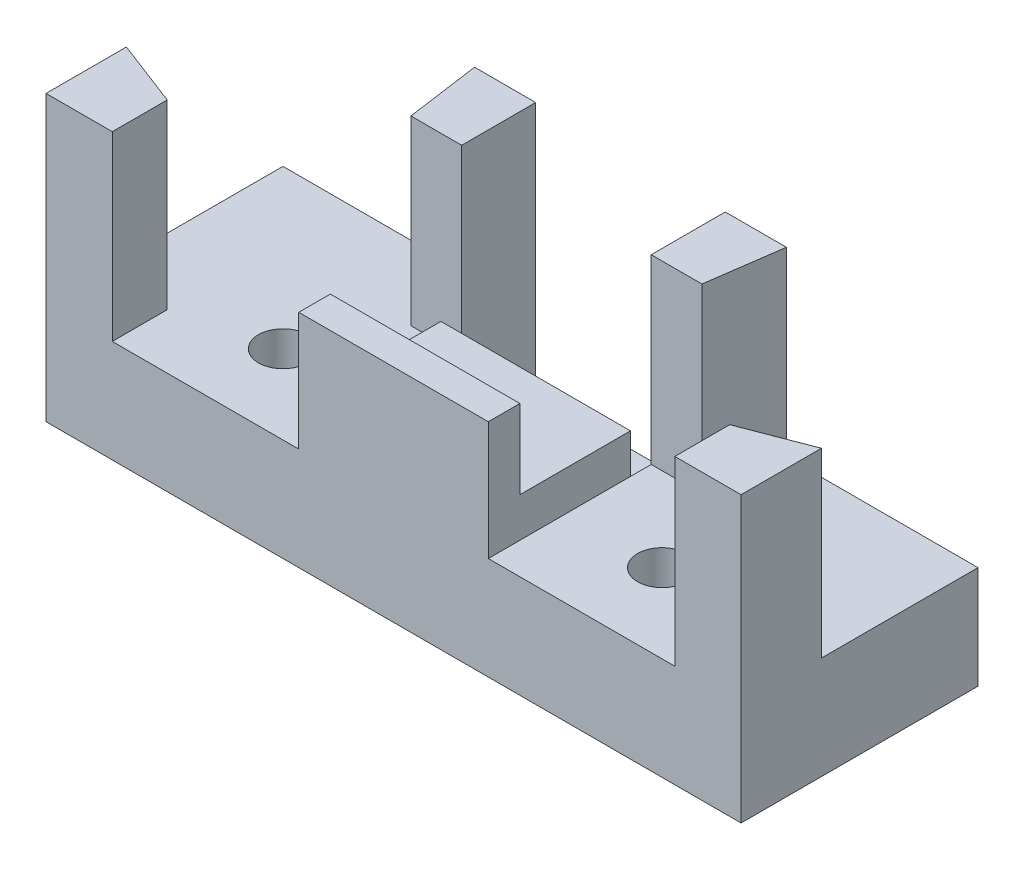
ISO-10303-21;
HEADER;
FILE_DESCRIPTION(('STEP AP214'),'2;1');
FILE_NAME('part.step','',(''),(''),'','','');
FILE_SCHEMA(('AUTOMOTIVE_DESIGN { 1 0 10303 214 1 1 1 1 }'));
ENDSEC;
DATA;
#1=APPLICATION_CONTEXT('core data for automotive mechanical design processes');
#2=APPLICATION_PROTOCOL_DEFINITION('international standard','automotive_design',2000,#1);
#3=PRODUCT_CONTEXT('',#1,'mechanical');
#4=PRODUCT('Part','Part','',(#3));
#5=PRODUCT_RELATED_PRODUCT_CATEGORY('part','',(#4));
#6=PRODUCT_DEFINITION_FORMATION('','',#4);
#7=PRODUCT_DEFINITION_CONTEXT('part definition',#1,'design');
#8=PRODUCT_DEFINITION('design','',#6,#7);
#9=PRODUCT_DEFINITION_SHAPE('','',#8);
#10=(LENGTH_UNIT() NAMED_UNIT(*) SI_UNIT(.MILLI.,.METRE.));
#11=(NAMED_UNIT(*) PLANE_ANGLE_UNIT() SI_UNIT($,.RADIAN.));
#12=(NAMED_UNIT(*) SI_UNIT($,.STERADIAN.) SOLID_ANGLE_UNIT());
#13=UNCERTAINTY_MEASURE_WITH_UNIT(LENGTH_MEASURE(1.E-05),#10,'distance_accuracy_value','');
#14=(GEOMETRIC_REPRESENTATION_CONTEXT(3) GLOBAL_UNCERTAINTY_ASSIGNED_CONTEXT((#13)) GLOBAL_UNIT_ASSIGNED_CONTEXT((#10,
#11,#12)) REPRESENTATION_CONTEXT('',''));
#15=CARTESIAN_POINT('',(0.,0.,0.));
#16=DIRECTION('',(0.,0.,1.));
#17=DIRECTION('',(1.,0.,0.));
#18=AXIS2_PLACEMENT_3D('',#15,#16,#17);
#19=CARTESIAN_POINT('',(16.,9.,0.));
#20=DIRECTION('',(1.,0.,0.));
#21=DIRECTION('',(0.,0.,-1.));
#22=AXIS2_PLACEMENT_3D('',#19,#20,#21);
#23=PLANE('',#22);
#24=DIRECTION('',(0.,1.,0.));
#25=VECTOR('',#24,1.);
#26=CARTESIAN_POINT('',(16.,2.,6.00000000000001));
#27=LINE('',#26,#25);
#28=CARTESIAN_POINT('',(16.,6.5,6.00000000000001));
#29=VERTEX_POINT('',#28);
#30=CARTESIAN_POINT('',(16.,9.,6.00000000000001));
#31=VERTEX_POINT('',#30);
#32=EDGE_CURVE('E278',#29,#31,#27,.T.);
#33=ORIENTED_EDGE('',*,*,#32,.F.);
#34=DIRECTION('',(0.,0.,-1.));
#35=VECTOR('',#34,1.);
#36=CARTESIAN_POINT('',(16.,6.5,15.));
#37=LINE('',#36,#35);
#38=CARTESIAN_POINT('',(16.,6.5,15.));
#39=VERTEX_POINT('',#38);
#40=EDGE_CURVE('E250',#39,#29,#37,.T.);
#41=ORIENTED_EDGE('',*,*,#40,.F.);
#42=DIRECTION('',(0.,-1.,0.));
#43=VECTOR('',#42,1.);
#44=CARTESIAN_POINT('',(16.,9.,15.));
#45=LINE('',#44,#43);
#46=CARTESIAN_POINT('',(16.,14.,15.));
#47=VERTEX_POINT('',#46);
#48=EDGE_CURVE('E397',#47,#39,#45,.T.);
#49=ORIENTED_EDGE('',*,*,#48,.F.);
#50=DIRECTION('',(0.,0.,1.));
#51=VECTOR('',#50,1.);
#52=CARTESIAN_POINT('',(16.,14.,13.));
#53=LINE('',#52,#51);
#54=CARTESIAN_POINT('',(16.,14.,13.));
#55=VERTEX_POINT('',#54);
#56=EDGE_CURVE('E361',#55,#47,#53,.T.);
#57=ORIENTED_EDGE('',*,*,#56,.F.);
#58=DIRECTION('',(0.,-1.,0.));
#59=VECTOR('',#58,1.);
#60=CARTESIAN_POINT('',(16.,14.,13.));
#61=LINE('',#60,#59);
#62=CARTESIAN_POINT('',(16.,9.,13.));
#63=VERTEX_POINT('',#62);
#64=EDGE_CURVE('E371',#55,#63,#61,.T.);
#65=ORIENTED_EDGE('',*,*,#64,.T.);
#66=DIRECTION('',(0.,0.,1.));
#67=VECTOR('',#66,1.);
#68=CARTESIAN_POINT('',(16.,9.,0.));
#69=LINE('',#68,#67);
#70=EDGE_CURVE('E389',#31,#63,#69,.T.);
#71=ORIENTED_EDGE('',*,*,#70,.F.);
#72=EDGE_LOOP('',(#33,#41,#49,#57,#65,#71));
#73=FACE_BOUND('',#72,.T.);
#74=ADVANCED_FACE('F32',(#73),#23,.F.);
#75=CARTESIAN_POINT('',(28.,9.,0.));
#76=DIRECTION('',(-1.,0.,0.));
#77=DIRECTION('',(0.,0.,1.));
#78=AXIS2_PLACEMENT_3D('',#75,#76,#77);
#79=PLANE('',#78);
#80=DIRECTION('',(0.,-1.,0.));
#81=VECTOR('',#80,1.);
#82=CARTESIAN_POINT('',(28.,9.,15.));
#83=LINE('',#82,#81);
#84=CARTESIAN_POINT('',(28.,14.,15.));
#85=VERTEX_POINT('',#84);
#86=CARTESIAN_POINT('',(28.,6.5,15.));
#87=VERTEX_POINT('',#86);
#88=EDGE_CURVE('E47',#85,#87,#83,.T.);
#89=ORIENTED_EDGE('',*,*,#88,.T.);
#90=DIRECTION('',(0.,0.,1.));
#91=VECTOR('',#90,1.);
#92=CARTESIAN_POINT('',(28.,6.5,15.));
#93=LINE('',#92,#91);
#94=CARTESIAN_POINT('',(28.,6.5,6.00000000000001));
#95=VERTEX_POINT('',#94);
#96=EDGE_CURVE('E235',#95,#87,#93,.T.);
#97=ORIENTED_EDGE('',*,*,#96,.F.);
#98=DIRECTION('',(0.,1.,0.));
#99=VECTOR('',#98,1.);
#100=CARTESIAN_POINT('',(28.,2.,6.00000000000001));
#101=LINE('',#100,#99);
#102=CARTESIAN_POINT('',(28.,9.,6.00000000000001));
#103=VERTEX_POINT('',#102);
#104=EDGE_CURVE('E284',#95,#103,#101,.T.);
#105=ORIENTED_EDGE('',*,*,#104,.T.);
#106=DIRECTION('',(0.,0.,-1.));
#107=VECTOR('',#106,1.);
#108=CARTESIAN_POINT('',(28.,9.,0.));
#109=LINE('',#108,#107);
#110=CARTESIAN_POINT('',(28.,9.,13.));
#111=VERTEX_POINT('',#110);
#112=EDGE_CURVE('E393',#111,#103,#109,.T.);
#113=ORIENTED_EDGE('',*,*,#112,.F.);
#114=DIRECTION('',(0.,-1.,0.));
#115=VECTOR('',#114,1.);
#116=CARTESIAN_POINT('',(28.,14.,13.));
#117=LINE('',#116,#115);
#118=CARTESIAN_POINT('',(28.,14.,13.));
#119=VERTEX_POINT('',#118);
#120=EDGE_CURVE('E376',#119,#111,#117,.T.);
#121=ORIENTED_EDGE('',*,*,#120,.F.);
#122=DIRECTION('',(0.,0.,-1.));
#123=VECTOR('',#122,1.);
#124=CARTESIAN_POINT('',(28.,14.,13.));
#125=LINE('',#124,#123);
#126=EDGE_CURVE('E367',#85,#119,#125,.T.);
#127=ORIENTED_EDGE('',*,*,#126,.F.);
#128=EDGE_LOOP('',(#89,#97,#105,#113,#121,#127));
#129=FACE_BOUND('',#128,.T.);
#130=ADVANCED_FACE('F489',(#129),#79,.F.);
#131=CARTESIAN_POINT('',(0.,5.,0.));
#132=DIRECTION('',(1.,0.,0.));
#133=DIRECTION('',(0.,0.,-1.));
#134=AXIS2_PLACEMENT_3D('',#131,#132,#133);
#135=PLANE('',#134);
#136=DIRECTION('',(0.,0.,1.));
#137=VECTOR('',#136,1.);
#138=CARTESIAN_POINT('',(0.,0.,0.));
#139=LINE('',#138,#137);
#140=CARTESIAN_POINT('',(0.,0.,0.));
#141=VERTEX_POINT('',#140);
#142=CARTESIAN_POINT('',(0.,0.,15.));
#143=VERTEX_POINT('',#142);
#144=EDGE_CURVE('E400',#141,#143,#139,.T.);
#145=ORIENTED_EDGE('',*,*,#144,.T.);
#146=DIRECTION('',(0.,-1.,0.));
#147=VECTOR('',#146,1.);
#148=CARTESIAN_POINT('',(0.,5.,15.));
#149=LINE('',#148,#147);
#150=CARTESIAN_POINT('',(0.,18.,15.));
#151=VERTEX_POINT('',#150);
#152=EDGE_CURVE('E11',#151,#143,#149,.T.);
#153=ORIENTED_EDGE('',*,*,#152,.F.);
#154=DIRECTION('',(0.,0.,1.));
#155=VECTOR('',#154,1.);
#156=CARTESIAN_POINT('',(0.,18.,15.));
#157=LINE('',#156,#155);
#158=CARTESIAN_POINT('',(0.,18.,9.91036712737541));
#159=VERTEX_POINT('',#158);
#160=EDGE_CURVE('E293',#159,#151,#157,.T.);
#161=ORIENTED_EDGE('',*,*,#160,.F.);
#162=DIRECTION('',(0.,-1.,0.));
#163=VECTOR('',#162,1.);
#164=CARTESIAN_POINT('',(0.,18.,9.91036712737541));
#165=LINE('',#164,#163);
#166=CARTESIAN_POINT('',(0.,6.5,9.91036712737541));
#167=VERTEX_POINT('',#166);
#168=EDGE_CURVE('E296',#159,#167,#165,.T.);
#169=ORIENTED_EDGE('',*,*,#168,.T.);
#170=DIRECTION('',(0.,0.,1.));
#171=VECTOR('',#170,1.);
#172=CARTESIAN_POINT('',(0.,6.5,0.));
#173=LINE('',#172,#171);
#174=CARTESIAN_POINT('',(0.,6.5,0.));
#175=VERTEX_POINT('',#174);
#176=EDGE_CURVE('E259',#175,#167,#173,.T.);
#177=ORIENTED_EDGE('',*,*,#176,.F.);
#178=DIRECTION('',(0.,-1.,0.));
#179=VECTOR('',#178,1.);
#180=CARTESIAN_POINT('',(0.,5.,0.));
#181=LINE('',#180,#179);
#182=EDGE_CURVE('E213',#175,#141,#181,.T.);
#183=ORIENTED_EDGE('',*,*,#182,.T.);
#184=EDGE_LOOP('',(#145,#153,#161,#169,#177,#183));
#185=FACE_BOUND('',#184,.T.);
#186=ADVANCED_FACE('F34',(#185),#135,.F.);
#187=CARTESIAN_POINT('',(0.,5.,15.));
#188=DIRECTION('',(0.,0.,-1.));
#189=DIRECTION('',(-1.,0.,0.));
#190=AXIS2_PLACEMENT_3D('',#187,#188,#189);
#191=PLANE('',#190);
#192=DIRECTION('',(1.,0.,0.));
#193=VECTOR('',#192,1.);
#194=CARTESIAN_POINT('',(0.,0.,15.));
#195=LINE('',#194,#193);
#196=CARTESIAN_POINT('',(44.,0.,15.));
#197=VERTEX_POINT('',#196);
#198=EDGE_CURVE('E403',#143,#197,#195,.T.);
#199=ORIENTED_EDGE('',*,*,#198,.T.);
#200=DIRECTION('',(0.,-1.,0.));
#201=VECTOR('',#200,1.);
#202=CARTESIAN_POINT('',(44.,5.,15.));
#203=LINE('',#202,#201);
#204=CARTESIAN_POINT('',(44.,18.,15.));
#205=VERTEX_POINT('',#204);
#206=EDGE_CURVE('E40',#205,#197,#203,.T.);
#207=ORIENTED_EDGE('',*,*,#206,.F.);
#208=DIRECTION('',(1.,0.,0.));
#209=VECTOR('',#208,1.);
#210=CARTESIAN_POINT('',(39.8039960341122,18.,15.));
#211=LINE('',#210,#209);
#212=CARTESIAN_POINT('',(39.8039960341122,18.,15.));
#213=VERTEX_POINT('',#212);
#214=EDGE_CURVE('E308',#213,#205,#211,.T.);
#215=ORIENTED_EDGE('',*,*,#214,.F.);
#216=DIRECTION('',(0.,-1.,0.));
#217=VECTOR('',#216,1.);
#218=CARTESIAN_POINT('',(39.8039960341122,18.,15.));
#219=LINE('',#218,#217);
#220=CARTESIAN_POINT('',(39.8039960341122,6.5,15.));
#221=VERTEX_POINT('',#220);
#222=EDGE_CURVE('E320',#213,#221,#219,.T.);
#223=ORIENTED_EDGE('',*,*,#222,.T.);
#224=DIRECTION('',(1.,0.,0.));
#225=VECTOR('',#224,1.);
#226=CARTESIAN_POINT('',(39.8039960341122,6.5,15.));
#227=LINE('',#226,#225);
#228=EDGE_CURVE('E239',#87,#221,#227,.T.);
#229=ORIENTED_EDGE('',*,*,#228,.F.);
#230=ORIENTED_EDGE('',*,*,#88,.F.);
#231=DIRECTION('',(1.,0.,0.));
#232=VECTOR('',#231,1.);
#233=CARTESIAN_POINT('',(16.,14.,15.));
#234=LINE('',#233,#232);
#235=EDGE_CURVE('E364',#47,#85,#234,.T.);
#236=ORIENTED_EDGE('',*,*,#235,.F.);
#237=ORIENTED_EDGE('',*,*,#48,.T.);
#238=DIRECTION('',(1.,0.,0.));
#239=VECTOR('',#238,1.);
#240=CARTESIAN_POINT('',(4.19600396588781,6.5,15.));
#241=LINE('',#240,#239);
#242=CARTESIAN_POINT('',(4.19600396588781,6.5,15.));
#243=VERTEX_POINT('',#242);
#244=EDGE_CURVE('E247',#243,#39,#241,.T.);
#245=ORIENTED_EDGE('',*,*,#244,.F.);
#246=DIRECTION('',(0.,-1.,0.));
#247=VECTOR('',#246,1.);
#248=CARTESIAN_POINT('',(4.19600396588781,18.,15.));
#249=LINE('',#248,#247);
#250=CARTESIAN_POINT('',(4.19600396588781,18.,15.));
#251=VERTEX_POINT('',#250);
#252=EDGE_CURVE('E302',#251,#243,#249,.T.);
#253=ORIENTED_EDGE('',*,*,#252,.F.);
#254=DIRECTION('',(1.,0.,0.));
#255=VECTOR('',#254,1.);
#256=CARTESIAN_POINT('',(4.19600396588781,18.,15.));
#257=LINE('',#256,#255);
#258=EDGE_CURVE('E283',#151,#251,#257,.T.);
#259=ORIENTED_EDGE('',*,*,#258,.F.);
#260=ORIENTED_EDGE('',*,*,#152,.T.);
#261=EDGE_LOOP('',(#199,#207,#215,#223,#229,#230,#236,#237,#245,#253,#259,#260));
#262=FACE_BOUND('',#261,.T.);
#263=ADVANCED_FACE('F433',(#262),#191,.F.);
#264=CARTESIAN_POINT('',(44.,5.,0.));
#265=DIRECTION('',(-1.,0.,0.));
#266=DIRECTION('',(0.,0.,1.));
#267=AXIS2_PLACEMENT_3D('',#264,#265,#266);
#268=PLANE('',#267);
#269=DIRECTION('',(0.,-1.,0.));
#270=VECTOR('',#269,1.);
#271=CARTESIAN_POINT('',(44.,5.,0.));
#272=LINE('',#271,#270);
#273=CARTESIAN_POINT('',(44.,6.5,0.));
#274=VERTEX_POINT('',#273);
#275=CARTESIAN_POINT('',(44.,0.,0.));
#276=VERTEX_POINT('',#275);
#277=EDGE_CURVE('E201',#274,#276,#272,.T.);
#278=ORIENTED_EDGE('',*,*,#277,.F.);
#279=DIRECTION('',(0.,0.,-1.));
#280=VECTOR('',#279,1.);
#281=CARTESIAN_POINT('',(44.,6.5,0.));
#282=LINE('',#281,#280);
#283=CARTESIAN_POINT('',(44.,6.5,9.91036712737542));
#284=VERTEX_POINT('',#283);
#285=EDGE_CURVE('E205',#284,#274,#282,.T.);
#286=ORIENTED_EDGE('',*,*,#285,.F.);
#287=DIRECTION('',(0.,-1.,0.));
#288=VECTOR('',#287,1.);
#289=CARTESIAN_POINT('',(44.,18.,9.91036712737542));
#290=LINE('',#289,#288);
#291=CARTESIAN_POINT('',(44.,18.,9.91036712737542));
#292=VERTEX_POINT('',#291);
#293=EDGE_CURVE('E318',#292,#284,#290,.T.);
#294=ORIENTED_EDGE('',*,*,#293,.F.);
#295=DIRECTION('',(0.,0.,-1.));
#296=VECTOR('',#295,1.);
#297=CARTESIAN_POINT('',(44.,18.,15.));
#298=LINE('',#297,#296);
#299=EDGE_CURVE('E311',#205,#292,#298,.T.);
#300=ORIENTED_EDGE('',*,*,#299,.F.);
#301=ORIENTED_EDGE('',*,*,#206,.T.);
#302=DIRECTION('',(0.,0.,-1.));
#303=VECTOR('',#302,1.);
#304=CARTESIAN_POINT('',(44.,0.,0.));
#305=LINE('',#304,#303);
#306=EDGE_CURVE('E209',#197,#276,#305,.T.);
#307=ORIENTED_EDGE('',*,*,#306,.T.);
#308=EDGE_LOOP('',(#278,#286,#294,#300,#301,#307));
#309=FACE_BOUND('',#308,.T.);
#310=ADVANCED_FACE('F203',(#309),#268,.F.);
#311=CARTESIAN_POINT('',(0.,5.,0.));
#312=DIRECTION('',(0.,0.,1.));
#313=DIRECTION('',(1.,0.,0.));
#314=AXIS2_PLACEMENT_3D('',#311,#312,#313);
#315=PLANE('',#314);
#316=ORIENTED_EDGE('',*,*,#182,.F.);
#317=DIRECTION('',(-1.,0.,0.));
#318=VECTOR('',#317,1.);
#319=CARTESIAN_POINT('',(12.1289881567913,6.5,0.));
#320=LINE('',#319,#318);
#321=CARTESIAN_POINT('',(12.1289881567913,6.5,0.));
#322=VERTEX_POINT('',#321);
#323=EDGE_CURVE('E256',#322,#175,#320,.T.);
#324=ORIENTED_EDGE('',*,*,#323,.F.);
#325=DIRECTION('',(0.,-1.,0.));
#326=VECTOR('',#325,1.);
#327=CARTESIAN_POINT('',(12.1289881567913,18.,0.));
#328=LINE('',#327,#326);
#329=CARTESIAN_POINT('',(12.1289881567913,18.,0.));
#330=VERTEX_POINT('',#329);
#331=EDGE_CURVE('E339',#330,#322,#328,.T.);
#332=ORIENTED_EDGE('',*,*,#331,.F.);
#333=DIRECTION('',(-1.,0.,0.));
#334=VECTOR('',#333,1.);
#335=CARTESIAN_POINT('',(16.,18.,0.));
#336=LINE('',#335,#334);
#337=CARTESIAN_POINT('',(16.,18.,0.));
#338=VERTEX_POINT('',#337);
#339=EDGE_CURVE('E326',#338,#330,#336,.T.);
#340=ORIENTED_EDGE('',*,*,#339,.F.);
#341=DIRECTION('',(0.,-1.,0.));
#342=VECTOR('',#341,1.);
#343=CARTESIAN_POINT('',(16.,18.,0.));
#344=LINE('',#343,#342);
#345=CARTESIAN_POINT('',(16.,2.,0.));
#346=VERTEX_POINT('',#345);
#347=EDGE_CURVE('E342',#338,#346,#344,.T.);
#348=ORIENTED_EDGE('',*,*,#347,.T.);
#349=DIRECTION('',(-1.,0.,0.));
#350=VECTOR('',#349,1.);
#351=CARTESIAN_POINT('',(16.,2.,0.));
#352=LINE('',#351,#350);
#353=CARTESIAN_POINT('',(28.,2.,0.));
#354=VERTEX_POINT('',#353);
#355=EDGE_CURVE('E275',#354,#346,#352,.T.);
#356=ORIENTED_EDGE('',*,*,#355,.F.);
#357=DIRECTION('',(0.,-1.,0.));
#358=VECTOR('',#357,1.);
#359=CARTESIAN_POINT('',(28.,18.,0.));
#360=LINE('',#359,#358);
#361=CARTESIAN_POINT('',(28.,18.,0.));
#362=VERTEX_POINT('',#361);
#363=EDGE_CURVE('E355',#362,#354,#360,.T.);
#364=ORIENTED_EDGE('',*,*,#363,.F.);
#365=DIRECTION('',(-1.,0.,0.));
#366=VECTOR('',#365,1.);
#367=CARTESIAN_POINT('',(28.,18.,0.));
#368=LINE('',#367,#366);
#369=CARTESIAN_POINT('',(31.8710118432087,18.,0.));
#370=VERTEX_POINT('',#369);
#371=EDGE_CURVE('E349',#370,#362,#368,.T.);
#372=ORIENTED_EDGE('',*,*,#371,.F.);
#373=DIRECTION('',(0.,-1.,0.));
#374=VECTOR('',#373,1.);
#375=CARTESIAN_POINT('',(31.8710118432087,18.,0.));
#376=LINE('',#375,#374);
#377=CARTESIAN_POINT('',(31.8710118432087,6.5,0.));
#378=VERTEX_POINT('',#377);
#379=EDGE_CURVE('E228',#370,#378,#376,.T.);
#380=ORIENTED_EDGE('',*,*,#379,.T.);
#381=DIRECTION('',(-1.,0.,0.));
#382=VECTOR('',#381,1.);
#383=CARTESIAN_POINT('',(31.8710118432087,6.5,0.));
#384=LINE('',#383,#382);
#385=EDGE_CURVE('E220',#274,#378,#384,.T.);
#386=ORIENTED_EDGE('',*,*,#385,.F.);
#387=ORIENTED_EDGE('',*,*,#277,.T.);
#388=DIRECTION('',(-1.,0.,0.));
#389=VECTOR('',#388,1.);
#390=CARTESIAN_POINT('',(0.,0.,0.));
#391=LINE('',#390,#389);
#392=EDGE_CURVE('E406',#276,#141,#391,.T.);
#393=ORIENTED_EDGE('',*,*,#392,.T.);
#394=EDGE_LOOP('',(#316,#324,#332,#340,#348,#356,#364,#372,#380,#386,#387,#393));
#395=FACE_BOUND('',#394,.T.);
#396=ADVANCED_FACE('F225',(#395),#315,.F.);
#397=CARTESIAN_POINT('',(0.,0.,0.));
#398=DIRECTION('',(0.,1.,0.));
#399=DIRECTION('',(0.,0.,1.));
#400=AXIS2_PLACEMENT_3D('',#397,#398,#399);
#401=PLANE('',#400);
#402=ORIENTED_EDGE('',*,*,#144,.F.);
#403=ORIENTED_EDGE('',*,*,#392,.F.);
#404=ORIENTED_EDGE('',*,*,#306,.F.);
#405=ORIENTED_EDGE('',*,*,#198,.F.);
#406=EDGE_LOOP('',(#402,#403,#404,#405));
#407=FACE_BOUND('',#406,.T.);
#408=ADVANCED_FACE('F413',(#407),#401,.F.);
#409=CARTESIAN_POINT('',(0.,9.,0.));
#410=DIRECTION('',(0.,1.,0.));
#411=DIRECTION('',(0.,0.,1.));
#412=AXIS2_PLACEMENT_3D('',#409,#410,#411);
#413=PLANE('',#412);
#414=DIRECTION('',(1.,0.,0.));
#415=VECTOR('',#414,1.);
#416=CARTESIAN_POINT('',(16.,9.,6.00000000000001));
#417=LINE('',#416,#415);
#418=EDGE_CURVE('E265',#31,#103,#417,.T.);
#419=ORIENTED_EDGE('',*,*,#418,.F.);
#420=ORIENTED_EDGE('',*,*,#70,.T.);
#421=DIRECTION('',(-1.,0.,0.));
#422=VECTOR('',#421,1.);
#423=CARTESIAN_POINT('',(16.,9.,13.));
#424=LINE('',#423,#422);
#425=EDGE_CURVE('E360',#111,#63,#424,.T.);
#426=ORIENTED_EDGE('',*,*,#425,.F.);
#427=ORIENTED_EDGE('',*,*,#112,.T.);
#428=EDGE_LOOP('',(#419,#420,#426,#427));
#429=FACE_BOUND('',#428,.T.);
#430=CARTESIAN_POINT('',(22.,9.,10.));
#431=DIRECTION('',(0.,1.,0.));
#432=DIRECTION('',(0.,0.,1.));
#433=AXIS2_PLACEMENT_3D('',#430,#431,#432);
#434=CIRCLE('',#433,1.55);
#435=CARTESIAN_POINT('',(22.,9.,11.55));
#436=VERTEX_POINT('',#435);
#437=EDGE_CURVE('E379',#436,#436,#434,.T.);
#438=ORIENTED_EDGE('',*,*,#437,.F.);
#439=EDGE_LOOP('',(#438));
#440=FACE_BOUND('',#439,.T.);
#441=ADVANCED_FACE('F499',(#429,#440),#413,.T.);
#442=CARTESIAN_POINT('',(22.,6.,10.));
#443=DIRECTION('',(0.,1.,0.));
#444=DIRECTION('',(0.,0.,1.));
#445=AXIS2_PLACEMENT_3D('',#442,#443,#444);
#446=CYLINDRICAL_SURFACE('',#445,1.55);
#447=CARTESIAN_POINT('',(22.,6.,10.));
#448=DIRECTION('',(0.,1.,0.));
#449=DIRECTION('',(0.,0.,1.));
#450=AXIS2_PLACEMENT_3D('',#447,#448,#449);
#451=CIRCLE('',#450,1.55);
#452=CARTESIAN_POINT('',(22.,6.,11.55));
#453=VERTEX_POINT('',#452);
#454=EDGE_CURVE('E380',#453,#453,#451,.T.);
#455=ORIENTED_EDGE('',*,*,#454,.F.);
#456=EDGE_LOOP('',(#455));
#457=FACE_BOUND('',#456,.T.);
#458=ORIENTED_EDGE('',*,*,#437,.T.);
#459=EDGE_LOOP('',(#458));
#460=FACE_BOUND('',#459,.T.);
#461=ADVANCED_FACE('F541',(#457,#460),#446,.F.);
#462=CARTESIAN_POINT('',(22.,6.,10.));
#463=DIRECTION('',(0.,1.,0.));
#464=DIRECTION('',(0.,0.,1.));
#465=AXIS2_PLACEMENT_3D('',#462,#463,#464);
#466=PLANE('',#465);
#467=ORIENTED_EDGE('',*,*,#454,.T.);
#468=EDGE_LOOP('',(#467));
#469=FACE_BOUND('',#468,.T.);
#470=ADVANCED_FACE('F612',(#469),#466,.T.);
#471=CARTESIAN_POINT('',(16.,14.,13.));
#472=DIRECTION('',(0.,0.,1.));
#473=DIRECTION('',(1.,0.,0.));
#474=AXIS2_PLACEMENT_3D('',#471,#472,#473);
#475=PLANE('',#474);
#476=ORIENTED_EDGE('',*,*,#425,.T.);
#477=ORIENTED_EDGE('',*,*,#64,.F.);
#478=DIRECTION('',(-1.,0.,0.));
#479=VECTOR('',#478,1.);
#480=CARTESIAN_POINT('',(16.,14.,13.));
#481=LINE('',#480,#479);
#482=EDGE_CURVE('E369',#119,#55,#481,.T.);
#483=ORIENTED_EDGE('',*,*,#482,.F.);
#484=ORIENTED_EDGE('',*,*,#120,.T.);
#485=EDGE_LOOP('',(#476,#477,#483,#484));
#486=FACE_BOUND('',#485,.T.);
#487=ADVANCED_FACE('F485',(#486),#475,.F.);
#488=CARTESIAN_POINT('',(0.,14.,0.));
#489=DIRECTION('',(0.,1.,0.));
#490=DIRECTION('',(0.,0.,1.));
#491=AXIS2_PLACEMENT_3D('',#488,#489,#490);
#492=PLANE('',#491);
#493=ORIENTED_EDGE('',*,*,#56,.T.);
#494=ORIENTED_EDGE('',*,*,#235,.T.);
#495=ORIENTED_EDGE('',*,*,#126,.T.);
#496=ORIENTED_EDGE('',*,*,#482,.T.);
#497=EDGE_LOOP('',(#493,#494,#495,#496));
#498=FACE_BOUND('',#497,.T.);
#499=ADVANCED_FACE('F478',(#498),#492,.T.);
#500=CARTESIAN_POINT('',(31.212307556098,18.,4.68692454051216));
#501=DIRECTION('',(0.,0.,-1.));
#502=DIRECTION('',(-1.,0.,0.));
#503=AXIS2_PLACEMENT_3D('',#500,#501,#502);
#504=PLANE('',#503);
#505=DIRECTION('',(0.,-1.,0.));
#506=VECTOR('',#505,1.);
#507=CARTESIAN_POINT('',(28.,18.,4.68692454051216));
#508=LINE('',#507,#506);
#509=CARTESIAN_POINT('',(28.,18.,4.68692454051216));
#510=VERTEX_POINT('',#509);
#511=CARTESIAN_POINT('',(28.,6.5,4.68692454051216));
#512=VERTEX_POINT('',#511);
#513=EDGE_CURVE('E353',#510,#512,#508,.T.);
#514=ORIENTED_EDGE('',*,*,#513,.T.);
#515=DIRECTION('',(-1.,0.,0.));
#516=VECTOR('',#515,1.);
#517=CARTESIAN_POINT('',(28.,6.5,4.68692454051215));
#518=LINE('',#517,#516);
#519=CARTESIAN_POINT('',(31.212307556098,6.5,4.68692454051216));
#520=VERTEX_POINT('',#519);
#521=EDGE_CURVE('E55',#520,#512,#518,.T.);
#522=ORIENTED_EDGE('',*,*,#521,.F.);
#523=DIRECTION('',(0.,-1.,0.));
#524=VECTOR('',#523,1.);
#525=CARTESIAN_POINT('',(31.212307556098,18.,4.68692454051216));
#526=LINE('',#525,#524);
#527=CARTESIAN_POINT('',(31.212307556098,18.,4.68692454051216));
#528=VERTEX_POINT('',#527);
#529=EDGE_CURVE('E358',#528,#520,#526,.T.);
#530=ORIENTED_EDGE('',*,*,#529,.F.);
#531=DIRECTION('',(1.,0.,0.));
#532=VECTOR('',#531,1.);
#533=CARTESIAN_POINT('',(31.212307556098,18.,4.68692454051216));
#534=LINE('',#533,#532);
#535=EDGE_CURVE('E344',#510,#528,#534,.T.);
#536=ORIENTED_EDGE('',*,*,#535,.F.);
#537=EDGE_LOOP('',(#514,#522,#530,#536));
#538=FACE_BOUND('',#537,.T.);
#539=ADVANCED_FACE('F476',(#538),#504,.F.);
#540=CARTESIAN_POINT('',(31.212307556098,18.,4.68692454051216));
#541=DIRECTION('',(-0.99026806874157,0.,-0.139173100960065));
#542=DIRECTION('',(-0.139173100960065,0.,0.99026806874157));
#543=AXIS2_PLACEMENT_3D('',#540,#541,#542);
#544=PLANE('',#543);
#545=ORIENTED_EDGE('',*,*,#529,.T.);
#546=DIRECTION('',(-0.139173100960065,0.,0.99026806874157));
#547=VECTOR('',#546,1.);
#548=CARTESIAN_POINT('',(31.212307556098,6.5,4.68692454051215));
#549=LINE('',#548,#547);
#550=EDGE_CURVE('E229',#378,#520,#549,.T.);
#551=ORIENTED_EDGE('',*,*,#550,.F.);
#552=ORIENTED_EDGE('',*,*,#379,.F.);
#553=DIRECTION('',(0.139173100960065,0.,-0.99026806874157));
#554=VECTOR('',#553,1.);
#555=CARTESIAN_POINT('',(31.212307556098,18.,4.68692454051216));
#556=LINE('',#555,#554);
#557=EDGE_CURVE('E347',#528,#370,#556,.T.);
#558=ORIENTED_EDGE('',*,*,#557,.F.);
#559=EDGE_LOOP('',(#545,#551,#552,#558));
#560=FACE_BOUND('',#559,.T.);
#561=ADVANCED_FACE('F475',(#560),#544,.F.);
#562=CARTESIAN_POINT('',(28.,18.,4.68692454051216));
#563=DIRECTION('',(1.,0.,0.));
#564=DIRECTION('',(0.,0.,-1.));
#565=AXIS2_PLACEMENT_3D('',#562,#563,#564);
#566=PLANE('',#565);
#567=ORIENTED_EDGE('',*,*,#363,.T.);
#568=DIRECTION('',(0.,0.,-1.));
#569=VECTOR('',#568,1.);
#570=CARTESIAN_POINT('',(28.,2.,0.));
#571=LINE('',#570,#569);
#572=CARTESIAN_POINT('',(28.,2.,6.00000000000001));
#573=VERTEX_POINT('',#572);
#574=EDGE_CURVE('E272',#573,#354,#571,.T.);
#575=ORIENTED_EDGE('',*,*,#574,.F.);
#576=EDGE_CURVE('E281',#573,#95,#101,.T.);
#577=ORIENTED_EDGE('',*,*,#576,.T.);
#578=EDGE_CURVE('E236',#512,#95,#93,.T.);
#579=ORIENTED_EDGE('',*,*,#578,.F.);
#580=ORIENTED_EDGE('',*,*,#513,.F.);
#581=DIRECTION('',(0.,0.,1.));
#582=VECTOR('',#581,1.);
#583=CARTESIAN_POINT('',(28.,18.,4.68692454051216));
#584=LINE('',#583,#582);
#585=EDGE_CURVE('E351',#362,#510,#584,.T.);
#586=ORIENTED_EDGE('',*,*,#585,.F.);
#587=EDGE_LOOP('',(#567,#575,#577,#579,#580,#586));
#588=FACE_BOUND('',#587,.T.);
#589=ADVANCED_FACE('F466',(#588),#566,.F.);
#590=CARTESIAN_POINT('',(0.,18.,0.));
#591=DIRECTION('',(0.,-1.,0.));
#592=DIRECTION('',(0.,0.,-1.));
#593=AXIS2_PLACEMENT_3D('',#590,#591,#592);
#594=PLANE('',#593);
#595=ORIENTED_EDGE('',*,*,#535,.T.);
#596=ORIENTED_EDGE('',*,*,#557,.T.);
#597=ORIENTED_EDGE('',*,*,#371,.T.);
#598=ORIENTED_EDGE('',*,*,#585,.T.);
#599=EDGE_LOOP('',(#595,#596,#597,#598));
#600=FACE_BOUND('',#599,.T.);
#601=ADVANCED_FACE('F472',(#600),#594,.F.);
#602=CARTESIAN_POINT('',(16.,18.,4.68692454051216));
#603=DIRECTION('',(-1.,0.,0.));
#604=DIRECTION('',(0.,0.,1.));
#605=AXIS2_PLACEMENT_3D('',#602,#603,#604);
#606=PLANE('',#605);
#607=CARTESIAN_POINT('',(16.,2.,6.00000000000001));
#608=VERTEX_POINT('',#607);
#609=EDGE_CURVE('E286',#608,#29,#27,.T.);
#610=ORIENTED_EDGE('',*,*,#609,.F.);
#611=DIRECTION('',(0.,0.,1.));
#612=VECTOR('',#611,1.);
#613=CARTESIAN_POINT('',(16.,2.,0.));
#614=LINE('',#613,#612);
#615=EDGE_CURVE('E266',#346,#608,#614,.T.);
#616=ORIENTED_EDGE('',*,*,#615,.F.);
#617=ORIENTED_EDGE('',*,*,#347,.F.);
#618=DIRECTION('',(0.,0.,-1.));
#619=VECTOR('',#618,1.);
#620=CARTESIAN_POINT('',(16.,18.,4.68692454051216));
#621=LINE('',#620,#619);
#622=CARTESIAN_POINT('',(16.,18.,4.68692454051216));
#623=VERTEX_POINT('',#622);
#624=EDGE_CURVE('E323',#623,#338,#621,.T.);
#625=ORIENTED_EDGE('',*,*,#624,.F.);
#626=DIRECTION('',(0.,-1.,0.));
#627=VECTOR('',#626,1.);
#628=CARTESIAN_POINT('',(16.,18.,4.68692454051216));
#629=LINE('',#628,#627);
#630=CARTESIAN_POINT('',(16.,6.5,4.68692454051216));
#631=VERTEX_POINT('',#630);
#632=EDGE_CURVE('E333',#623,#631,#629,.T.);
#633=ORIENTED_EDGE('',*,*,#632,.T.);
#634=EDGE_CURVE('E249',#29,#631,#37,.T.);
#635=ORIENTED_EDGE('',*,*,#634,.F.);
#636=EDGE_LOOP('',(#610,#616,#617,#625,#633,#635));
#637=FACE_BOUND('',#636,.T.);
#638=ADVANCED_FACE('F444',(#637),#606,.F.);
#639=CARTESIAN_POINT('',(12.787692443902,18.,4.68692454051216));
#640=DIRECTION('',(0.99026806874157,0.,-0.139173100960065));
#641=DIRECTION('',(-0.139173100960065,0.,-0.99026806874157));
#642=AXIS2_PLACEMENT_3D('',#639,#640,#641);
#643=PLANE('',#642);
#644=ORIENTED_EDGE('',*,*,#331,.T.);
#645=DIRECTION('',(-0.139173100960065,0.,-0.99026806874157));
#646=VECTOR('',#645,1.);
#647=CARTESIAN_POINT('',(12.787692443902,6.5,4.68692454051216));
#648=LINE('',#647,#646);
#649=CARTESIAN_POINT('',(12.787692443902,6.5,4.68692454051216));
#650=VERTEX_POINT('',#649);
#651=EDGE_CURVE('E254',#650,#322,#648,.T.);
#652=ORIENTED_EDGE('',*,*,#651,.F.);
#653=DIRECTION('',(0.,-1.,0.));
#654=VECTOR('',#653,1.);
#655=CARTESIAN_POINT('',(12.787692443902,18.,4.68692454051216));
#656=LINE('',#655,#654);
#657=CARTESIAN_POINT('',(12.787692443902,18.,4.68692454051216));
#658=VERTEX_POINT('',#657);
#659=EDGE_CURVE('E336',#658,#650,#656,.T.);
#660=ORIENTED_EDGE('',*,*,#659,.F.);
#661=DIRECTION('',(0.139173100960065,0.,0.99026806874157));
#662=VECTOR('',#661,1.);
#663=CARTESIAN_POINT('',(12.787692443902,18.,4.68692454051216));
#664=LINE('',#663,#662);
#665=EDGE_CURVE('E328',#330,#658,#664,.T.);
#666=ORIENTED_EDGE('',*,*,#665,.F.);
#667=EDGE_LOOP('',(#644,#652,#660,#666));
#668=FACE_BOUND('',#667,.T.);
#669=ADVANCED_FACE('F459',(#668),#643,.F.);
#670=CARTESIAN_POINT('',(12.787692443902,18.,4.68692454051216));
#671=DIRECTION('',(0.,0.,-1.));
#672=DIRECTION('',(-1.,0.,0.));
#673=AXIS2_PLACEMENT_3D('',#670,#671,#672);
#674=PLANE('',#673);
#675=ORIENTED_EDGE('',*,*,#659,.T.);
#676=DIRECTION('',(-1.,0.,0.));
#677=VECTOR('',#676,1.);
#678=CARTESIAN_POINT('',(16.,6.5,4.68692454051216));
#679=LINE('',#678,#677);
#680=EDGE_CURVE('E252',#631,#650,#679,.T.);
#681=ORIENTED_EDGE('',*,*,#680,.F.);
#682=ORIENTED_EDGE('',*,*,#632,.F.);
#683=DIRECTION('',(1.,0.,0.));
#684=VECTOR('',#683,1.);
#685=CARTESIAN_POINT('',(12.787692443902,18.,4.68692454051216));
#686=LINE('',#685,#684);
#687=EDGE_CURVE('E330',#658,#623,#686,.T.);
#688=ORIENTED_EDGE('',*,*,#687,.F.);
#689=EDGE_LOOP('',(#675,#681,#682,#688));
#690=FACE_BOUND('',#689,.T.);
#691=ADVANCED_FACE('F451',(#690),#674,.F.);
#692=CARTESIAN_POINT('',(0.,18.,0.));
#693=DIRECTION('',(0.,1.,0.));
#694=DIRECTION('',(0.,0.,1.));
#695=AXIS2_PLACEMENT_3D('',#692,#693,#694);
#696=PLANE('',#695);
#697=ORIENTED_EDGE('',*,*,#624,.T.);
#698=ORIENTED_EDGE('',*,*,#339,.T.);
#699=ORIENTED_EDGE('',*,*,#665,.T.);
#700=ORIENTED_EDGE('',*,*,#687,.T.);
#701=EDGE_LOOP('',(#697,#698,#699,#700));
#702=FACE_BOUND('',#701,.T.);
#703=ADVANCED_FACE('F453',(#702),#696,.T.);
#704=CARTESIAN_POINT('',(39.8039960341122,18.,11.5210621407457));
#705=DIRECTION('',(1.,0.,0.));
#706=DIRECTION('',(0.,0.,-1.));
#707=AXIS2_PLACEMENT_3D('',#704,#705,#706);
#708=PLANE('',#707);
#709=DIRECTION('',(0.,-1.,0.));
#710=VECTOR('',#709,1.);
#711=CARTESIAN_POINT('',(39.8039960341122,18.,11.5210621407457));
#712=LINE('',#711,#710);
#713=CARTESIAN_POINT('',(39.8039960341122,18.,11.5210621407457));
#714=VERTEX_POINT('',#713);
#715=CARTESIAN_POINT('',(39.8039960341122,6.5,11.5210621407457));
#716=VERTEX_POINT('',#715);
#717=EDGE_CURVE('E315',#714,#716,#712,.T.);
#718=ORIENTED_EDGE('',*,*,#717,.T.);
#719=DIRECTION('',(0.,0.,-1.));
#720=VECTOR('',#719,1.);
#721=CARTESIAN_POINT('',(39.8039960341122,6.5,11.5210621407457));
#722=LINE('',#721,#720);
#723=EDGE_CURVE('E242',#221,#716,#722,.T.);
#724=ORIENTED_EDGE('',*,*,#723,.F.);
#725=ORIENTED_EDGE('',*,*,#222,.F.);
#726=DIRECTION('',(0.,0.,1.));
#727=VECTOR('',#726,1.);
#728=CARTESIAN_POINT('',(39.8039960341122,18.,11.5210621407457));
#729=LINE('',#728,#727);
#730=EDGE_CURVE('E305',#714,#213,#729,.T.);
#731=ORIENTED_EDGE('',*,*,#730,.F.);
#732=EDGE_LOOP('',(#718,#724,#725,#731));
#733=FACE_BOUND('',#732,.T.);
#734=ADVANCED_FACE('F581',(#733),#708,.F.);
#735=CARTESIAN_POINT('',(39.8039960341122,18.,11.5210621407457));
#736=DIRECTION('',(0.358367949545305,0.,0.9335804264972));
#737=DIRECTION('',(0.9335804264972,0.,-0.358367949545305));
#738=AXIS2_PLACEMENT_3D('',#735,#736,#737);
#739=PLANE('',#738);
#740=ORIENTED_EDGE('',*,*,#293,.T.);
#741=DIRECTION('',(0.9335804264972,0.,-0.358367949545305));
#742=VECTOR('',#741,1.);
#743=CARTESIAN_POINT('',(44.,6.5,9.9103671273754));
#744=LINE('',#743,#742);
#745=EDGE_CURVE('E222',#716,#284,#744,.T.);
#746=ORIENTED_EDGE('',*,*,#745,.F.);
#747=ORIENTED_EDGE('',*,*,#717,.F.);
#748=DIRECTION('',(-0.9335804264972,0.,0.358367949545305));
#749=VECTOR('',#748,1.);
#750=CARTESIAN_POINT('',(39.8039960341122,18.,11.5210621407457));
#751=LINE('',#750,#749);
#752=EDGE_CURVE('E313',#292,#714,#751,.T.);
#753=ORIENTED_EDGE('',*,*,#752,.F.);
#754=EDGE_LOOP('',(#740,#746,#747,#753));
#755=FACE_BOUND('',#754,.T.);
#756=ADVANCED_FACE('F567',(#755),#739,.F.);
#757=CARTESIAN_POINT('',(0.,18.,0.));
#758=DIRECTION('',(0.,1.,0.));
#759=DIRECTION('',(0.,0.,1.));
#760=AXIS2_PLACEMENT_3D('',#757,#758,#759);
#761=PLANE('',#760);
#762=ORIENTED_EDGE('',*,*,#730,.T.);
#763=ORIENTED_EDGE('',*,*,#214,.T.);
#764=ORIENTED_EDGE('',*,*,#299,.T.);
#765=ORIENTED_EDGE('',*,*,#752,.T.);
#766=EDGE_LOOP('',(#762,#763,#764,#765));
#767=FACE_BOUND('',#766,.T.);
#768=ADVANCED_FACE('F562',(#767),#761,.T.);
#769=CARTESIAN_POINT('',(4.19600396588781,18.,11.5210621407457));
#770=DIRECTION('',(-1.,0.,0.));
#771=DIRECTION('',(0.,0.,1.));
#772=AXIS2_PLACEMENT_3D('',#769,#770,#771);
#773=PLANE('',#772);
#774=ORIENTED_EDGE('',*,*,#252,.T.);
#775=DIRECTION('',(0.,0.,1.));
#776=VECTOR('',#775,1.);
#777=CARTESIAN_POINT('',(4.19600396588781,6.5,11.5210621407457));
#778=LINE('',#777,#776);
#779=CARTESIAN_POINT('',(4.19600396588781,6.5,11.5210621407457));
#780=VERTEX_POINT('',#779);
#781=EDGE_CURVE('E263',#780,#243,#778,.T.);
#782=ORIENTED_EDGE('',*,*,#781,.F.);
#783=DIRECTION('',(0.,-1.,0.));
#784=VECTOR('',#783,1.);
#785=CARTESIAN_POINT('',(4.19600396588781,18.,11.5210621407457));
#786=LINE('',#785,#784);
#787=CARTESIAN_POINT('',(4.19600396588781,18.,11.5210621407457));
#788=VERTEX_POINT('',#787);
#789=EDGE_CURVE('E299',#788,#780,#786,.T.);
#790=ORIENTED_EDGE('',*,*,#789,.F.);
#791=DIRECTION('',(0.,0.,-1.));
#792=VECTOR('',#791,1.);
#793=CARTESIAN_POINT('',(4.19600396588781,18.,11.5210621407457));
#794=LINE('',#793,#792);
#795=EDGE_CURVE('E289',#251,#788,#794,.T.);
#796=ORIENTED_EDGE('',*,*,#795,.F.);
#797=EDGE_LOOP('',(#774,#782,#790,#796));
#798=FACE_BOUND('',#797,.T.);
#799=ADVANCED_FACE('F429',(#798),#773,.F.);
#800=CARTESIAN_POINT('',(4.19600396588781,18.,11.5210621407457));
#801=DIRECTION('',(-0.358367949545305,0.,0.9335804264972));
#802=DIRECTION('',(0.9335804264972,0.,0.358367949545305));
#803=AXIS2_PLACEMENT_3D('',#800,#801,#802);
#804=PLANE('',#803);
#805=ORIENTED_EDGE('',*,*,#789,.T.);
#806=DIRECTION('',(0.9335804264972,0.,0.358367949545305));
#807=VECTOR('',#806,1.);
#808=CARTESIAN_POINT('',(0.,6.5,9.91036712737541));
#809=LINE('',#808,#807);
#810=EDGE_CURVE('E261',#167,#780,#809,.T.);
#811=ORIENTED_EDGE('',*,*,#810,.F.);
#812=ORIENTED_EDGE('',*,*,#168,.F.);
#813=DIRECTION('',(-0.9335804264972,0.,-0.358367949545305));
#814=VECTOR('',#813,1.);
#815=CARTESIAN_POINT('',(4.19600396588781,18.,11.5210621407457));
#816=LINE('',#815,#814);
#817=EDGE_CURVE('E291',#788,#159,#816,.T.);
#818=ORIENTED_EDGE('',*,*,#817,.F.);
#819=EDGE_LOOP('',(#805,#811,#812,#818));
#820=FACE_BOUND('',#819,.T.);
#821=ADVANCED_FACE('F425',(#820),#804,.F.);
#822=CARTESIAN_POINT('',(0.,18.,0.));
#823=DIRECTION('',(0.,-1.,0.));
#824=DIRECTION('',(0.,0.,-1.));
#825=AXIS2_PLACEMENT_3D('',#822,#823,#824);
#826=PLANE('',#825);
#827=ORIENTED_EDGE('',*,*,#258,.T.);
#828=ORIENTED_EDGE('',*,*,#795,.T.);
#829=ORIENTED_EDGE('',*,*,#817,.T.);
#830=ORIENTED_EDGE('',*,*,#160,.T.);
#831=EDGE_LOOP('',(#827,#828,#829,#830));
#832=FACE_BOUND('',#831,.T.);
#833=ADVANCED_FACE('F549',(#832),#826,.F.);
#834=CARTESIAN_POINT('',(16.,2.,6.00000000000001));
#835=DIRECTION('',(0.,0.,1.));
#836=DIRECTION('',(1.,0.,0.));
#837=AXIS2_PLACEMENT_3D('',#834,#835,#836);
#838=PLANE('',#837);
#839=ORIENTED_EDGE('',*,*,#418,.T.);
#840=ORIENTED_EDGE('',*,*,#104,.F.);
#841=ORIENTED_EDGE('',*,*,#576,.F.);
#842=DIRECTION('',(1.,0.,0.));
#843=VECTOR('',#842,1.);
#844=CARTESIAN_POINT('',(16.,2.,6.00000000000001));
#845=LINE('',#844,#843);
#846=EDGE_CURVE('E269',#608,#573,#845,.T.);
#847=ORIENTED_EDGE('',*,*,#846,.F.);
#848=ORIENTED_EDGE('',*,*,#609,.T.);
#849=ORIENTED_EDGE('',*,*,#32,.T.);
#850=EDGE_LOOP('',(#839,#840,#841,#847,#848,#849));
#851=FACE_BOUND('',#850,.T.);
#852=ADVANCED_FACE('F529',(#851),#838,.F.);
#853=CARTESIAN_POINT('',(0.,2.,0.));
#854=DIRECTION('',(0.,1.,0.));
#855=DIRECTION('',(0.,0.,1.));
#856=AXIS2_PLACEMENT_3D('',#853,#854,#855);
#857=PLANE('',#856);
#858=ORIENTED_EDGE('',*,*,#615,.T.);
#859=ORIENTED_EDGE('',*,*,#846,.T.);
#860=ORIENTED_EDGE('',*,*,#574,.T.);
#861=ORIENTED_EDGE('',*,*,#355,.T.);
#862=EDGE_LOOP('',(#858,#859,#860,#861));
#863=FACE_BOUND('',#862,.T.);
#864=ADVANCED_FACE('F463',(#863),#857,.T.);
#865=CARTESIAN_POINT('',(0.,6.5,0.));
#866=DIRECTION('',(0.,1.,0.));
#867=DIRECTION('',(0.,0.,1.));
#868=AXIS2_PLACEMENT_3D('',#865,#866,#867);
#869=PLANE('',#868);
#870=ORIENTED_EDGE('',*,*,#244,.T.);
#871=ORIENTED_EDGE('',*,*,#40,.T.);
#872=ORIENTED_EDGE('',*,*,#634,.T.);
#873=ORIENTED_EDGE('',*,*,#680,.T.);
#874=ORIENTED_EDGE('',*,*,#651,.T.);
#875=ORIENTED_EDGE('',*,*,#323,.T.);
#876=ORIENTED_EDGE('',*,*,#176,.T.);
#877=ORIENTED_EDGE('',*,*,#810,.T.);
#878=ORIENTED_EDGE('',*,*,#781,.T.);
#879=EDGE_LOOP('',(#870,#871,#872,#873,#874,#875,#876,#877,#878));
#880=FACE_BOUND('',#879,.T.);
#881=CARTESIAN_POINT('',(10.,6.5,10.));
#882=DIRECTION('',(0.,1.,0.));
#883=DIRECTION('',(0.,0.,1.));
#884=AXIS2_PLACEMENT_3D('',#881,#882,#883);
#885=CIRCLE('',#884,1.55);
#886=CARTESIAN_POINT('',(10.,6.5,11.55));
#887=VERTEX_POINT('',#886);
#888=EDGE_CURVE('E244',#887,#887,#885,.T.);
#889=ORIENTED_EDGE('',*,*,#888,.F.);
#890=EDGE_LOOP('',(#889));
#891=FACE_BOUND('',#890,.T.);
#892=ADVANCED_FACE('F421',(#880,#891),#869,.T.);
#893=CARTESIAN_POINT('',(10.,2.,10.));
#894=DIRECTION('',(0.,1.,0.));
#895=DIRECTION('',(0.,0.,1.));
#896=AXIS2_PLACEMENT_3D('',#893,#894,#895);
#897=PLANE('',#896);
#898=CARTESIAN_POINT('',(10.,2.,10.));
#899=DIRECTION('',(0.,1.,0.));
#900=DIRECTION('',(0.,0.,1.));
#901=AXIS2_PLACEMENT_3D('',#898,#899,#900);
#902=CIRCLE('',#901,1.55);
#903=CARTESIAN_POINT('',(10.,2.,11.55));
#904=VERTEX_POINT('',#903);
#905=EDGE_CURVE('E386',#904,#904,#902,.T.);
#906=ORIENTED_EDGE('',*,*,#905,.T.);
#907=EDGE_LOOP('',(#906));
#908=FACE_BOUND('',#907,.T.);
#909=ADVANCED_FACE('F637',(#908),#897,.T.);
#910=CARTESIAN_POINT('',(10.,2.,10.));
#911=DIRECTION('',(0.,1.,0.));
#912=DIRECTION('',(0.,0.,1.));
#913=AXIS2_PLACEMENT_3D('',#910,#911,#912);
#914=CYLINDRICAL_SURFACE('',#913,1.55);
#915=ORIENTED_EDGE('',*,*,#905,.F.);
#916=EDGE_LOOP('',(#915));
#917=FACE_BOUND('',#916,.T.);
#918=ORIENTED_EDGE('',*,*,#888,.T.);
#919=EDGE_LOOP('',(#918));
#920=FACE_BOUND('',#919,.T.);
#921=ADVANCED_FACE('F641',(#917,#920),#914,.F.);
#922=CARTESIAN_POINT('',(0.,6.5,0.));
#923=DIRECTION('',(0.,1.,0.));
#924=DIRECTION('',(0.,0.,1.));
#925=AXIS2_PLACEMENT_3D('',#922,#923,#924);
#926=PLANE('',#925);
#927=ORIENTED_EDGE('',*,*,#745,.T.);
#928=ORIENTED_EDGE('',*,*,#285,.T.);
#929=ORIENTED_EDGE('',*,*,#385,.T.);
#930=ORIENTED_EDGE('',*,*,#550,.T.);
#931=ORIENTED_EDGE('',*,*,#521,.T.);
#932=ORIENTED_EDGE('',*,*,#578,.T.);
#933=ORIENTED_EDGE('',*,*,#96,.T.);
#934=ORIENTED_EDGE('',*,*,#228,.T.);
#935=ORIENTED_EDGE('',*,*,#723,.T.);
#936=EDGE_LOOP('',(#927,#928,#929,#930,#931,#932,#933,#934,#935));
#937=FACE_BOUND('',#936,.T.);
#938=CARTESIAN_POINT('',(34.,6.5,9.99999999999999));
#939=DIRECTION('',(0.,1.,0.));
#940=DIRECTION('',(0.,0.,-1.));
#941=AXIS2_PLACEMENT_3D('',#938,#939,#940);
#942=CIRCLE('',#941,1.55000000000001);
#943=CARTESIAN_POINT('',(34.,6.5,8.44999999999998));
#944=VERTEX_POINT('',#943);
#945=EDGE_CURVE('E800',#944,#944,#942,.T.);
#946=ORIENTED_EDGE('',*,*,#945,.F.);
#947=EDGE_LOOP('',(#946));
#948=FACE_BOUND('',#947,.T.);
#949=ADVANCED_FACE('F217',(#937,#948),#926,.T.);
#950=CARTESIAN_POINT('',(34.,2.,10.));
#951=DIRECTION('',(0.,1.,0.));
#952=DIRECTION('',(0.,0.,1.));
#953=AXIS2_PLACEMENT_3D('',#950,#951,#952);
#954=PLANE('',#953);
#955=CARTESIAN_POINT('',(34.,2.,10.));
#956=DIRECTION('',(0.,1.,0.));
#957=DIRECTION('',(0.,0.,1.));
#958=AXIS2_PLACEMENT_3D('',#955,#956,#957);
#959=CIRCLE('',#958,1.54999999999999);
#960=CARTESIAN_POINT('',(34.,2.,11.55));
#961=VERTEX_POINT('',#960);
#962=EDGE_CURVE('E383',#961,#961,#959,.T.);
#963=ORIENTED_EDGE('',*,*,#962,.T.);
#964=EDGE_LOOP('',(#963));
#965=FACE_BOUND('',#964,.T.);
#966=ADVANCED_FACE('F649',(#965),#954,.T.);
#967=CARTESIAN_POINT('',(34.,2.,10.));
#968=DIRECTION('',(0.,1.,0.));
#969=DIRECTION('',(0.,0.,1.));
#970=AXIS2_PLACEMENT_3D('',#967,#968,#969);
#971=CYLINDRICAL_SURFACE('',#970,1.54999999999999);
#972=ORIENTED_EDGE('',*,*,#962,.F.);
#973=EDGE_LOOP('',(#972));
#974=FACE_BOUND('',#973,.T.);
#975=ORIENTED_EDGE('',*,*,#945,.T.);
#976=EDGE_LOOP('',(#975));
#977=FACE_BOUND('',#976,.T.);
#978=ADVANCED_FACE('F654',(#974,#977),#971,.F.);
#979=CLOSED_SHELL('',(#74,#130,#186,#263,#310,#396,#408,#441,#461,#470,#487,#499,#539,#561,#589,
#601,#638,#669,#691,#703,#734,#756,#768,#799,#821,#833,#852,#864,#892,#909,#921,#949,#966,#978));
#980=MANIFOLD_SOLID_BREP('B2',#979);
#981=ADVANCED_BREP_SHAPE_REPRESENTATION('',(#18,#980),#14);
#982=SHAPE_DEFINITION_REPRESENTATION(#9,#981);
ENDSEC;
END-ISO-10303-21;
